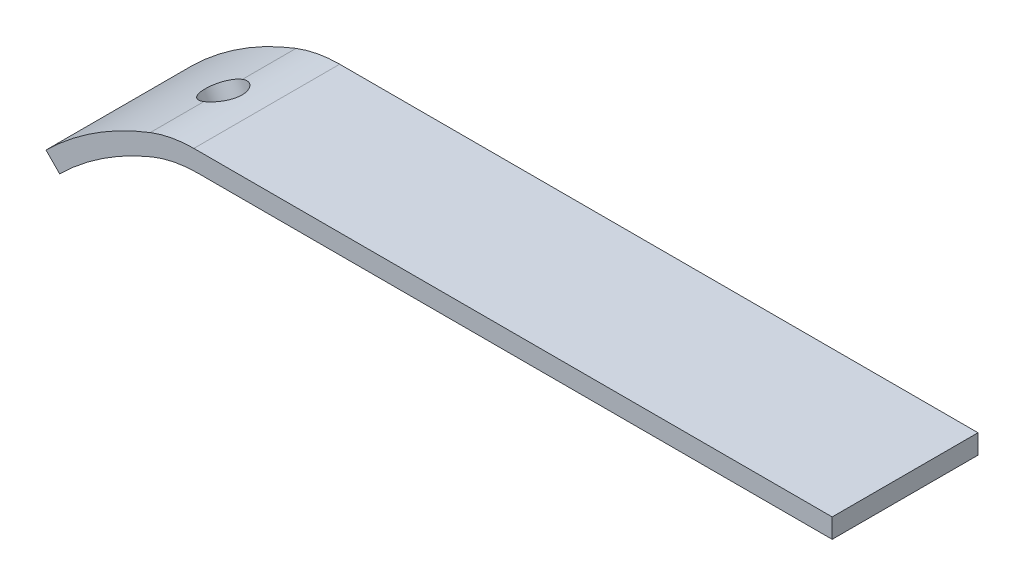
ISO-10303-21;
HEADER;
FILE_DESCRIPTION(('STEP AP214'),'2;1');
FILE_NAME('part.step','',(''),(''),'','','');
FILE_SCHEMA(('AUTOMOTIVE_DESIGN { 1 0 10303 214 1 1 1 1 }'));
ENDSEC;
DATA;
#1=APPLICATION_CONTEXT('core data for automotive mechanical design processes');
#2=APPLICATION_PROTOCOL_DEFINITION('international standard','automotive_design',2000,#1);
#3=PRODUCT_CONTEXT('',#1,'mechanical');
#4=PRODUCT('Part','Part','',(#3));
#5=PRODUCT_RELATED_PRODUCT_CATEGORY('part','',(#4));
#6=PRODUCT_DEFINITION_FORMATION('','',#4);
#7=PRODUCT_DEFINITION_CONTEXT('part definition',#1,'design');
#8=PRODUCT_DEFINITION('design','',#6,#7);
#9=PRODUCT_DEFINITION_SHAPE('','',#8);
#10=(LENGTH_UNIT() NAMED_UNIT(*) SI_UNIT(.MILLI.,.METRE.));
#11=(NAMED_UNIT(*) PLANE_ANGLE_UNIT() SI_UNIT($,.RADIAN.));
#12=(NAMED_UNIT(*) SI_UNIT($,.STERADIAN.) SOLID_ANGLE_UNIT());
#13=UNCERTAINTY_MEASURE_WITH_UNIT(LENGTH_MEASURE(1.E-05),#10,'distance_accuracy_value','');
#14=(GEOMETRIC_REPRESENTATION_CONTEXT(3) GLOBAL_UNCERTAINTY_ASSIGNED_CONTEXT((#13)) GLOBAL_UNIT_ASSIGNED_CONTEXT((#10,
#11,#12)) REPRESENTATION_CONTEXT('',''));
#15=CARTESIAN_POINT('',(0.,0.,0.));
#16=DIRECTION('',(0.,0.,1.));
#17=DIRECTION('',(1.,0.,0.));
#18=AXIS2_PLACEMENT_3D('',#15,#16,#17);
#19=CARTESIAN_POINT('',(0.,-11.,-6.));
#20=DIRECTION('',(0.,1.,0.));
#21=DIRECTION('',(-1.,0.,0.));
#22=AXIS2_PLACEMENT_3D('',#19,#20,#21);
#23=PLANE('',#22);
#24=DIRECTION('',(-1.,0.,0.));
#25=VECTOR('',#24,1.);
#26=CARTESIAN_POINT('',(0.,-11.,6.));
#27=LINE('',#26,#25);
#28=CARTESIAN_POINT('',(5.42857144064035,-11.,6.));
#29=VERTEX_POINT('',#28);
#30=CARTESIAN_POINT('',(-47.1037127257916,-11.,6.));
#31=VERTEX_POINT('',#30);
#32=EDGE_CURVE('E130',#29,#31,#27,.T.);
#33=ORIENTED_EDGE('',*,*,#32,.F.);
#34=DIRECTION('',(0.,0.,1.));
#35=VECTOR('',#34,1.);
#36=CARTESIAN_POINT('',(5.42857144064035,-11.,-6.));
#37=LINE('',#36,#35);
#38=CARTESIAN_POINT('',(5.42857144064035,-11.,-6.));
#39=VERTEX_POINT('',#38);
#40=EDGE_CURVE('E27',#39,#29,#37,.T.);
#41=ORIENTED_EDGE('',*,*,#40,.F.);
#42=DIRECTION('',(-1.,0.,0.));
#43=VECTOR('',#42,1.);
#44=CARTESIAN_POINT('',(0.,-11.,-6.));
#45=LINE('',#44,#43);
#46=CARTESIAN_POINT('',(-47.1037127257916,-11.,-6.));
#47=VERTEX_POINT('',#46);
#48=EDGE_CURVE('E152',#39,#47,#45,.T.);
#49=ORIENTED_EDGE('',*,*,#48,.T.);
#50=DIRECTION('',(0.,0.,1.));
#51=VECTOR('',#50,1.);
#52=CARTESIAN_POINT('',(-47.1037127257916,-11.,-6.));
#53=LINE('',#52,#51);
#54=EDGE_CURVE('E113',#47,#31,#53,.T.);
#55=ORIENTED_EDGE('',*,*,#54,.T.);
#56=EDGE_LOOP('',(#33,#41,#49,#55));
#57=FACE_BOUND('',#56,.T.);
#58=ADVANCED_FACE('F16',(#57),#23,.T.);
#59=CARTESIAN_POINT('',(5.42857144064035,0.,-6.));
#60=DIRECTION('',(-1.,0.,0.));
#61=DIRECTION('',(0.,0.,1.));
#62=AXIS2_PLACEMENT_3D('',#59,#60,#61);
#63=PLANE('',#62);
#64=DIRECTION('',(0.,-1.,0.));
#65=VECTOR('',#64,1.);
#66=CARTESIAN_POINT('',(5.42857144064035,0.,6.));
#67=LINE('',#66,#65);
#68=CARTESIAN_POINT('',(5.42857144064035,-12.6,6.));
#69=VERTEX_POINT('',#68);
#70=EDGE_CURVE('E150',#29,#69,#67,.T.);
#71=ORIENTED_EDGE('',*,*,#70,.T.);
#72=DIRECTION('',(0.,0.,1.));
#73=VECTOR('',#72,1.);
#74=CARTESIAN_POINT('',(5.42857144064035,-12.6,-6.));
#75=LINE('',#74,#73);
#76=CARTESIAN_POINT('',(5.42857144064035,-12.6,-6.));
#77=VERTEX_POINT('',#76);
#78=EDGE_CURVE('E154',#77,#69,#75,.T.);
#79=ORIENTED_EDGE('',*,*,#78,.F.);
#80=DIRECTION('',(0.,-1.,0.));
#81=VECTOR('',#80,1.);
#82=CARTESIAN_POINT('',(5.42857144064035,0.,-6.));
#83=LINE('',#82,#81);
#84=EDGE_CURVE('E115',#39,#77,#83,.T.);
#85=ORIENTED_EDGE('',*,*,#84,.F.);
#86=ORIENTED_EDGE('',*,*,#40,.T.);
#87=EDGE_LOOP('',(#71,#79,#85,#86));
#88=FACE_BOUND('',#87,.T.);
#89=ADVANCED_FACE('F227',(#88),#63,.F.);
#90=CARTESIAN_POINT('',(0.,-12.6,-6.));
#91=DIRECTION('',(0.,1.,0.));
#92=DIRECTION('',(-1.,0.,0.));
#93=AXIS2_PLACEMENT_3D('',#90,#91,#92);
#94=PLANE('',#93);
#95=DIRECTION('',(-1.,0.,0.));
#96=VECTOR('',#95,1.);
#97=CARTESIAN_POINT('',(0.,-12.6,6.));
#98=LINE('',#97,#96);
#99=CARTESIAN_POINT('',(-46.7978503877676,-12.6,6.));
#100=VERTEX_POINT('',#99);
#101=EDGE_CURVE('E148',#69,#100,#98,.T.);
#102=ORIENTED_EDGE('',*,*,#101,.T.);
#103=DIRECTION('',(0.,0.,1.));
#104=VECTOR('',#103,1.);
#105=CARTESIAN_POINT('',(-46.7978503877676,-12.6,-6.));
#106=LINE('',#105,#104);
#107=CARTESIAN_POINT('',(-46.7978503877676,-12.6,-6.));
#108=VERTEX_POINT('',#107);
#109=EDGE_CURVE('E157',#108,#100,#106,.T.);
#110=ORIENTED_EDGE('',*,*,#109,.F.);
#111=DIRECTION('',(-1.,0.,0.));
#112=VECTOR('',#111,1.);
#113=CARTESIAN_POINT('',(0.,-12.6,-6.));
#114=LINE('',#113,#112);
#115=EDGE_CURVE('E120',#77,#108,#114,.T.);
#116=ORIENTED_EDGE('',*,*,#115,.F.);
#117=ORIENTED_EDGE('',*,*,#78,.T.);
#118=EDGE_LOOP('',(#102,#110,#116,#117));
#119=FACE_BOUND('',#118,.T.);
#120=ADVANCED_FACE('F232',(#119),#94,.F.);
#121=CARTESIAN_POINT('',(-46.7978503877676,-22.6,-6.));
#122=DIRECTION('',(0.,0.,1.));
#123=DIRECTION('',(1.,0.,0.));
#124=AXIS2_PLACEMENT_3D('',#121,#122,#123);
#125=CYLINDRICAL_SURFACE('',#124,10.);
#126=DIRECTION('',(0.,0.,1.));
#127=VECTOR('',#126,1.);
#128=CARTESIAN_POINT('',(-50.5892017560295,-13.3465868566037,-6.));
#129=LINE('',#128,#127);
#130=CARTESIAN_POINT('',(-50.5892017560295,-13.3465868566037,1.40630201190142));
#131=VERTEX_POINT('',#130);
#132=CARTESIAN_POINT('',(-50.5892017560295,-13.3465868566037,6.));
#133=VERTEX_POINT('',#132);
#134=EDGE_CURVE('E162',#131,#133,#129,.T.);
#135=ORIENTED_EDGE('',*,*,#134,.F.);
#136=CARTESIAN_POINT('',(-50.5892017560295,-13.3465868566037,1.40630201190142));
#137=CARTESIAN_POINT('',(-50.5520496670737,-13.3313635589773,1.42713984775884));
#138=CARTESIAN_POINT('',(-50.5140023155539,-13.3160375079772,1.4462568671757));
#139=CARTESIAN_POINT('',(-50.4363562063143,-13.2853332566281,1.48095436338339));
#140=CARTESIAN_POINT('',(-50.3967577009205,-13.2699550651294,1.4965354125915));
#141=CARTESIAN_POINT('',(-50.2762016289959,-13.2240508716272,1.53776425487576));
#142=CARTESIAN_POINT('',(-50.1932722084305,-13.1936680575505,1.55801575027674));
#143=CARTESIAN_POINT('',(-50.0246638882375,-13.134501099906,1.58366585753326));
#144=CARTESIAN_POINT('',(-49.9389852013488,-13.1057168331106,1.58906561582953));
#145=CARTESIAN_POINT('',(-49.7671656629489,-13.0505860543978,1.58515398771584));
#146=CARTESIAN_POINT('',(-49.6810247210741,-13.0242400389603,1.57583961214163));
#147=CARTESIAN_POINT('',(-49.5088497025879,-12.9740614758049,1.54262407443541));
#148=CARTESIAN_POINT('',(-49.4228548927167,-12.9502923871773,1.51842440034765));
#149=CARTESIAN_POINT('',(-49.2551670935594,-12.9062329736609,1.45597417535625));
#150=CARTESIAN_POINT('',(-49.1734753610281,-12.8859436612133,1.41771954529971));
#151=CARTESIAN_POINT('',(-49.0144374263015,-12.8484046830824,1.32687030274768));
#152=CARTESIAN_POINT('',(-48.9372836209628,-12.8312591495028,1.27389511678075));
#153=CARTESIAN_POINT('',(-48.7924047418641,-12.8006508407546,1.15543592418182));
#154=CARTESIAN_POINT('',(-48.7246799227561,-12.7871881650406,1.08995157982396));
#155=CARTESIAN_POINT('',(-48.6013678859014,-12.7637784995651,0.948396408813739));
#156=CARTESIAN_POINT('',(-48.5457244844513,-12.7538150969111,0.872377402139647));
#157=CARTESIAN_POINT('',(-48.448491240883,-12.7370475263159,0.71150521712667));
#158=CARTESIAN_POINT('',(-48.4068961605136,-12.730242180463,0.626655347058047));
#159=CARTESIAN_POINT('',(-48.3415345059889,-12.7198136007712,0.45527362365517));
#160=CARTESIAN_POINT('',(-48.3169451497471,-12.7160418007847,0.369065069896105));
#161=CARTESIAN_POINT('',(-48.2834112587148,-12.7109451616178,0.193596033875882));
#162=CARTESIAN_POINT('',(-48.2744599072543,-12.7096192562478,0.104336898683925));
#163=CARTESIAN_POINT('',(-48.2727122981858,-12.7093591041251,-0.06915346677925));
#164=CARTESIAN_POINT('',(-48.2790111832585,-12.7102909014106,-0.153376759898088));
#165=CARTESIAN_POINT('',(-48.3055899816486,-12.7143083569367,-0.319524436062706));
#166=CARTESIAN_POINT('',(-48.3258693521256,-12.7173939315496,-0.401448908239578));
#167=CARTESIAN_POINT('',(-48.3793501986663,-12.7258124750662,-0.560333631980942));
#168=CARTESIAN_POINT('',(-48.4124827386205,-12.7311334670549,-0.637317855018251));
#169=CARTESIAN_POINT('',(-48.4903495310641,-12.7441895702334,-0.784943184467404));
#170=CARTESIAN_POINT('',(-48.5350862124577,-12.7519251869058,-0.855582958727722));
#171=CARTESIAN_POINT('',(-48.6371069977368,-12.7704553555874,-0.992341994389819));
#172=CARTESIAN_POINT('',(-48.6949072853594,-12.7813837005662,-1.05805769099229));
#173=CARTESIAN_POINT('',(-48.8196929284721,-12.8063184434769,-1.17941474945886));
#174=CARTESIAN_POINT('',(-48.8866811622815,-12.8203258068089,-1.23505294160557));
#175=CARTESIAN_POINT('',(-49.032084414682,-12.8524847461421,-1.33804496239601));
#176=CARTESIAN_POINT('',(-49.1109404012898,-12.8708320524982,-1.38471644767167));
#177=CARTESIAN_POINT('',(-49.2744579055781,-12.9111660534161,-1.46429155194732));
#178=CARTESIAN_POINT('',(-49.3591199169781,-12.9331530577075,-1.49719399839376));
#179=CARTESIAN_POINT('',(-49.5337266832706,-12.98109444308,-1.54882651230193));
#180=CARTESIAN_POINT('',(-49.6237459048452,-13.0071240010865,-1.56723644873825));
#181=CARTESIAN_POINT('',(-49.8047314566125,-13.0623057697099,-1.58793335844507));
#182=CARTESIAN_POINT('',(-49.8956980793809,-13.0914589724376,-1.59021519371668));
#183=CARTESIAN_POINT('',(-50.0739599592865,-13.1514138183453,-1.57841036226661));
#184=CARTESIAN_POINT('',(-50.1612922588499,-13.1821706454726,-1.56465122756652));
#185=CARTESIAN_POINT('',(-50.3314798941514,-13.2446994469815,-1.5214337329202));
#186=CARTESIAN_POINT('',(-50.4143446765329,-13.2764690335495,-1.49201005492969));
#187=CARTESIAN_POINT('',(-50.5099054017281,-13.3144758664036,-1.44764431339406));
#188=CARTESIAN_POINT('',(-50.5259894978632,-13.3209226343895,-1.43979816924253));
#189=CARTESIAN_POINT('',(-50.5578343011927,-13.3337810996439,-1.42350246975071));
#190=CARTESIAN_POINT('',(-50.5735953926374,-13.3401928310203,-1.41505369226911));
#191=CARTESIAN_POINT('',(-50.5892017560295,-13.3465868566037,-1.40630201190142));
#192=B_SPLINE_CURVE_WITH_KNOTS('',3,(#136,#137,#138,#139,#140,#141,#142,#143,#144,#145,#146,
#147,#148,#149,#150,#151,#152,#153,#154,#155,#156,#157,#158,#159,#160,#161,#162,#163,#164,#165,
#166,#167,#168,#169,#170,#171,#172,#173,#174,#175,#176,#177,#178,#179,#180,#181,#182,#183,#184,
#185,#186,#187,#188,#189,#190,#191),.UNSPECIFIED.,.F.,.F.,(4,2,2,2,2,2,2,2,2,2,2,2,2,2,2,2,2,2,
2,2,2,2,2,2,2,2,2,4),(0.,0.135619947350567,0.271217924305152,0.541652181266713,
0.812065562182067,1.08253388441915,1.35861150174577,1.63476930812235,1.91886480483646,
2.20296797272719,2.48572021352179,2.76836690670491,3.03614457134399,3.3038054814556,
3.55597792488842,3.808140577411,4.05896908466461,4.30985013615237,4.5732955813446,
4.83682374572379,5.11589810854294,5.3949962321404,5.68009882790606,5.96529224594577,
6.24476296534796,6.52361748254869,6.58067648876442,6.63766313335133),.UNSPECIFIED.);
#193=CARTESIAN_POINT('',(-50.5892017560295,-13.3465868566037,-1.40630201190142));
#194=VERTEX_POINT('',#193);
#195=EDGE_CURVE('E33',#131,#194,#192,.T.);
#196=ORIENTED_EDGE('',*,*,#195,.T.);
#197=CARTESIAN_POINT('',(-50.5892017560295,-13.3465868566037,-6.));
#198=VERTEX_POINT('',#197);
#199=EDGE_CURVE('E160',#198,#194,#129,.T.);
#200=ORIENTED_EDGE('',*,*,#199,.F.);
#201=CARTESIAN_POINT('',(-46.7978503877676,-22.6,-6.));
#202=DIRECTION('',(0.,0.,1.));
#203=DIRECTION('',(1.,0.,0.));
#204=AXIS2_PLACEMENT_3D('',#201,#202,#203);
#205=CIRCLE('',#204,10.);
#206=EDGE_CURVE('E126',#108,#198,#205,.T.);
#207=ORIENTED_EDGE('',*,*,#206,.F.);
#208=ORIENTED_EDGE('',*,*,#109,.T.);
#209=CARTESIAN_POINT('',(-46.7978503877676,-22.6,6.));
#210=DIRECTION('',(0.,0.,1.));
#211=DIRECTION('',(1.,0.,0.));
#212=AXIS2_PLACEMENT_3D('',#209,#210,#211);
#213=CIRCLE('',#212,10.);
#214=EDGE_CURVE('E145',#100,#133,#213,.T.);
#215=ORIENTED_EDGE('',*,*,#214,.T.);
#216=EDGE_LOOP('',(#135,#196,#200,#207,#208,#215));
#217=FACE_BOUND('',#216,.T.);
#218=ADVANCED_FACE('F173',(#217),#125,.F.);
#219=CARTESIAN_POINT('',(-41.7174395542967,-34.999573612151,-6.));
#220=DIRECTION('',(0.,0.,1.));
#221=DIRECTION('',(1.,0.,0.));
#222=AXIS2_PLACEMENT_3D('',#219,#220,#221);
#223=CYLINDRICAL_SURFACE('',#222,23.4);
#224=ORIENTED_EDGE('',*,*,#199,.T.);
#225=CARTESIAN_POINT('',(-50.5892017560295,-13.3465868566037,-1.40630201190142));
#226=CARTESIAN_POINT('',(-50.6259338497092,-13.3616364544577,-1.38570040443848));
#227=CARTESIAN_POINT('',(-50.6618115343082,-13.3764461056886,-1.36344508729487));
#228=CARTESIAN_POINT('',(-50.7316483322269,-13.4054663949299,-1.31576126678133));
#229=CARTESIAN_POINT('',(-50.7656074670764,-13.4196770396619,-1.29033279903072));
#230=CARTESIAN_POINT('',(-50.8641989138108,-13.4611924027626,-1.20956586061412));
#231=CARTESIAN_POINT('',(-50.9256522334502,-13.4874245668834,-1.14968574898929));
#232=CARTESIAN_POINT('',(-51.0382560916435,-13.5359727940275,-1.01953087055874));
#233=CARTESIAN_POINT('',(-51.0893999442166,-13.5582863144993,-0.949249409085705));
#234=CARTESIAN_POINT('',(-51.1799798644692,-13.5981067556392,-0.800294931328933));
#235=CARTESIAN_POINT('',(-51.219419069756,-13.6156149643488,-0.721624171623601));
#236=CARTESIAN_POINT('',(-51.2854039029488,-13.6450573108592,-0.558457618103908));
#237=CARTESIAN_POINT('',(-51.3120004627231,-13.6570134598813,-0.4739863773012));
#238=CARTESIAN_POINT('',(-51.351839583601,-13.6749676848998,-0.301326992332803));
#239=CARTESIAN_POINT('',(-51.3650800562684,-13.680964829109,-0.213138269125016));
#240=CARTESIAN_POINT('',(-51.3778380818541,-13.6867429539977,-0.0357610861229038));
#241=CARTESIAN_POINT('',(-51.3773845798186,-13.6865370461123,0.0534248667192619));
#242=CARTESIAN_POINT('',(-51.3628387872053,-13.6799503610255,0.2304388370502));
#243=CARTESIAN_POINT('',(-51.3487476776402,-13.6735701185198,0.318266971456508));
#244=CARTESIAN_POINT('',(-51.3073048417091,-13.6549022491895,0.490046627614792));
#245=CARTESIAN_POINT('',(-51.2799580462292,-13.642616819007,0.573999578160107));
#246=CARTESIAN_POINT('',(-51.2127153671649,-13.6126363824801,0.735703461586438));
#247=CARTESIAN_POINT('',(-51.1728172949778,-13.5949404327028,0.813453309848116));
#248=CARTESIAN_POINT('',(-51.0814841391716,-13.5548270607035,0.960634276743199));
#249=CARTESIAN_POINT('',(-51.0300337893789,-13.5324033932829,1.03005419951034));
#250=CARTESIAN_POINT('',(-50.9170156325412,-13.4837291578181,1.15848654478691));
#251=CARTESIAN_POINT('',(-50.8554572682622,-13.4574821640312,1.21750857519144));
#252=CARTESIAN_POINT('',(-50.7580940567472,-13.4165304961836,1.29602722184476));
#253=CARTESIAN_POINT('',(-50.7254795870156,-13.40289499625,1.3201535156204));
#254=CARTESIAN_POINT('',(-50.6585681632784,-13.3751075754405,1.36545244908869));
#255=CARTESIAN_POINT('',(-50.6242744938421,-13.3609566755876,1.38663056625313));
#256=CARTESIAN_POINT('',(-50.5892017560295,-13.3465868566037,1.40630201190143));
#257=B_SPLINE_CURVE_WITH_KNOTS('',3,(#225,#226,#227,#228,#229,#230,#231,#232,#233,#234,#235,
#236,#237,#238,#239,#240,#241,#242,#243,#244,#245,#246,#247,#248,#249,#250,#251,#252,#253,#254,
#255,#256),.UNSPECIFIED.,.F.,.F.,(4,2,2,2,2,2,2,2,2,2,2,2,2,2,2,4),(0.,0.134088604249115,
0.26817570345873,0.535963798447449,0.803925006769434,1.07181431903162,1.33863231713914,
1.60549203001262,1.87178771928133,2.13806034948765,2.40423400679801,2.67045410333267,
2.93702809848224,3.20335446611124,3.33163197498382,3.45966787970708),.UNSPECIFIED.);
#258=EDGE_CURVE('E103',#194,#131,#257,.T.);
#259=ORIENTED_EDGE('',*,*,#258,.T.);
#260=ORIENTED_EDGE('',*,*,#134,.T.);
#261=CARTESIAN_POINT('',(-41.7174395542967,-34.999573612151,6.));
#262=DIRECTION('',(0.,0.,1.));
#263=DIRECTION('',(1.,0.,0.));
#264=AXIS2_PLACEMENT_3D('',#261,#262,#263);
#265=CIRCLE('',#264,23.4);
#266=CARTESIAN_POINT('',(-58.1500788342331,-18.3403909702717,6.));
#267=VERTEX_POINT('',#266);
#268=EDGE_CURVE('E142',#133,#267,#265,.T.);
#269=ORIENTED_EDGE('',*,*,#268,.T.);
#270=DIRECTION('',(0.,0.,1.));
#271=VECTOR('',#270,1.);
#272=CARTESIAN_POINT('',(-58.1500788342331,-18.3403909702717,-6.));
#273=LINE('',#272,#271);
#274=CARTESIAN_POINT('',(-58.1500788342331,-18.3403909702717,-6.));
#275=VERTEX_POINT('',#274);
#276=EDGE_CURVE('E111',#275,#267,#273,.T.);
#277=ORIENTED_EDGE('',*,*,#276,.F.);
#278=CARTESIAN_POINT('',(-41.7174395542967,-34.999573612151,-6.));
#279=DIRECTION('',(0.,0.,1.));
#280=DIRECTION('',(1.,0.,0.));
#281=AXIS2_PLACEMENT_3D('',#278,#279,#280);
#282=CIRCLE('',#281,23.4);
#283=EDGE_CURVE('E185',#198,#275,#282,.T.);
#284=ORIENTED_EDGE('',*,*,#283,.F.);
#285=EDGE_LOOP('',(#224,#259,#260,#269,#277,#284));
#286=FACE_BOUND('',#285,.T.);
#287=ADVANCED_FACE('F169',(#286),#223,.F.);
#288=CARTESIAN_POINT('',(-38.6424464658694,-38.1169591160836,-6.));
#289=DIRECTION('',(-0.711930882131594,-0.702249541877622,0.));
#290=DIRECTION('',(0.702249541877622,-0.711930882131594,0.));
#291=AXIS2_PLACEMENT_3D('',#288,#289,#290);
#292=PLANE('',#291);
#293=DIRECTION('',(0.702249541877622,-0.711930882131594,0.));
#294=VECTOR('',#293,1.);
#295=CARTESIAN_POINT('',(-38.6424464658694,-38.1169591160836,6.));
#296=LINE('',#295,#294);
#297=CARTESIAN_POINT('',(-59.2736781012373,-17.2013015588612,6.));
#298=VERTEX_POINT('',#297);
#299=EDGE_CURVE('E139',#298,#267,#296,.T.);
#300=ORIENTED_EDGE('',*,*,#299,.F.);
#301=DIRECTION('',(0.,0.,1.));
#302=VECTOR('',#301,1.);
#303=CARTESIAN_POINT('',(-59.2736781012373,-17.2013015588612,-6.));
#304=LINE('',#303,#302);
#305=CARTESIAN_POINT('',(-59.2736781012373,-17.2013015588612,-6.));
#306=VERTEX_POINT('',#305);
#307=EDGE_CURVE('E109',#306,#298,#304,.T.);
#308=ORIENTED_EDGE('',*,*,#307,.F.);
#309=DIRECTION('',(0.702249541877622,-0.711930882131594,0.));
#310=VECTOR('',#309,1.);
#311=CARTESIAN_POINT('',(-38.6424464658694,-38.1169591160836,-6.));
#312=LINE('',#311,#310);
#313=EDGE_CURVE('E181',#306,#275,#312,.T.);
#314=ORIENTED_EDGE('',*,*,#313,.T.);
#315=ORIENTED_EDGE('',*,*,#276,.T.);
#316=EDGE_LOOP('',(#300,#308,#314,#315));
#317=FACE_BOUND('',#316,.T.);
#318=ADVANCED_FACE('F179',(#317),#292,.T.);
#319=CARTESIAN_POINT('',(-41.7174395542967,-34.999573612151,-6.));
#320=DIRECTION('',(0.,0.,1.));
#321=DIRECTION('',(1.,0.,0.));
#322=AXIS2_PLACEMENT_3D('',#319,#320,#321);
#323=CYLINDRICAL_SURFACE('',#322,25.);
#324=CARTESIAN_POINT('',(-50.6945615067881,-11.6669509252327,-1.58745428520288));
#325=CARTESIAN_POINT('',(-50.7368228500294,-11.6832100668387,-1.58779319719321));
#326=CARTESIAN_POINT('',(-50.77903323006,-11.6995830272249,-1.58624150291836));
#327=CARTESIAN_POINT('',(-50.8630974006721,-11.7324514241177,-1.57936251914526));
#328=CARTESIAN_POINT('',(-50.9049511877341,-11.7489468618303,-1.57403519242448));
#329=CARTESIAN_POINT('',(-51.0294945018439,-11.7984189754524,-1.5524155780309));
#330=CARTESIAN_POINT('',(-51.1112688270078,-11.8314210546113,-1.53048643307643));
#331=CARTESIAN_POINT('',(-51.2699299916243,-11.8963854771918,-1.47210567541371));
#332=CARTESIAN_POINT('',(-51.3468131431839,-11.9283470274044,-1.43564325179328));
#333=CARTESIAN_POINT('',(-51.493482444978,-11.9901121454132,-1.34917187816782));
#334=CARTESIAN_POINT('',(-51.5632710852983,-12.019916469304,-1.29916770388602));
#335=CARTESIAN_POINT('',(-51.6932910321326,-12.0760622063373,-1.18743379956691));
#336=CARTESIAN_POINT('',(-51.7535921139119,-12.1024286306614,-1.12579779496819));
#337=CARTESIAN_POINT('',(-51.8636307553395,-12.1509756186833,-0.992274529855961));
#338=CARTESIAN_POINT('',(-51.9133667179228,-12.1731555494778,-0.920385722229758));
#339=CARTESIAN_POINT('',(-52.000592596138,-12.212317475948,-0.768953698081089));
#340=CARTESIAN_POINT('',(-52.0381655250343,-12.2293346552514,-0.689467381065809));
#341=CARTESIAN_POINT('',(-52.1005314374826,-12.257705099896,-0.524689523502273));
#342=CARTESIAN_POINT('',(-52.1253255717389,-12.2690588752123,-0.43939850643863));
#343=CARTESIAN_POINT('',(-52.1614279598682,-12.2856240764579,-0.265697384438442));
#344=CARTESIAN_POINT('',(-52.1727755743033,-12.2908534292295,-0.17729716686465));
#345=CARTESIAN_POINT('',(-52.1818200794063,-12.2950197478932,0.00034790898318282));
#346=CARTESIAN_POINT('',(-52.1795167249316,-12.2939566007854,0.0895927823967187));
#347=CARTESIAN_POINT('',(-52.1613263280128,-12.2855839369627,0.266314827014353));
#348=CARTESIAN_POINT('',(-52.1454503727717,-12.278279518628,0.353793381403975));
#349=CARTESIAN_POINT('',(-52.1005457876552,-12.2577243138576,0.524575310970601));
#350=CARTESIAN_POINT('',(-52.0715172798032,-12.2444735825892,0.607878724874741));
#351=CARTESIAN_POINT('',(-52.0010619707574,-12.2125466289623,0.767978791642297));
#352=CARTESIAN_POINT('',(-51.9596311519591,-12.1938686485584,0.844773325659876));
#353=CARTESIAN_POINT('',(-51.8654802218463,-12.1518183762733,0.989658331190841));
#354=CARTESIAN_POINT('',(-51.8127605036522,-12.1284462478611,1.05774910566881));
#355=CARTESIAN_POINT('',(-51.6973494841761,-12.0778510419144,1.18344097824541));
#356=CARTESIAN_POINT('',(-51.6346409521015,-12.0506213191421,1.24102357447994));
#357=CARTESIAN_POINT('',(-51.5010033092387,-11.9933319398292,1.34398535227355));
#358=CARTESIAN_POINT('',(-51.4300719968603,-11.9632715257978,1.38936125472991));
#359=CARTESIAN_POINT('',(-51.2815446599213,-11.9012098853625,1.46689875733028));
#360=CARTESIAN_POINT('',(-51.2039137236108,-11.8691987840052,1.49898536952172));
#361=CARTESIAN_POINT('',(-51.0445064610471,-11.8044622339692,1.5487351293835));
#362=CARTESIAN_POINT('',(-50.9627352986038,-11.7717377027739,1.5664157957685));
#363=CARTESIAN_POINT('',(-50.8493249213764,-11.7270624390174,1.58054766756406));
#364=CARTESIAN_POINT('',(-50.8184344938783,-11.7149649919236,1.58335832772381));
#365=CARTESIAN_POINT('',(-50.7565597212108,-11.6908755892691,1.58693347675493));
#366=CARTESIAN_POINT('',(-50.7255756515724,-11.6788834811092,1.58770170279836));
#367=CARTESIAN_POINT('',(-50.6945615067881,-11.6669509252327,1.58745428520288));
#368=B_SPLINE_CURVE_WITH_KNOTS('',3,(#324,#325,#326,#327,#328,#329,#330,#331,#332,#333,#334,
#335,#336,#337,#338,#339,#340,#341,#342,#343,#344,#345,#346,#347,#348,#349,#350,#351,#352,#353,
#354,#355,#356,#357,#358,#359,#360,#361,#362,#363,#364,#365,#366,#367),.UNSPECIFIED.,.F.,.F.,(4,
2,2,2,2,2,2,2,2,2,2,2,2,2,2,2,2,2,2,2,2,4),(0.,0.135765601497907,0.271532541476046,
0.542739963939759,0.814149507899564,1.0854634591452,1.35467800461173,1.62393321669242,
1.89130998273441,2.15866266783783,2.42523081138485,2.69180374194524,2.95815912191792,
3.22451203081428,3.49095131561122,3.75738132353645,4.02427600446942,4.29124231029383,
4.55969516127863,4.82782106408503,4.92765364582123,5.02730343138721),.UNSPECIFIED.);
#369=CARTESIAN_POINT('',(-50.6945615067881,-11.6669509252327,-1.58745428520288));
#370=VERTEX_POINT('',#369);
#371=CARTESIAN_POINT('',(-50.6945615067881,-11.6669509252327,1.58745428520288));
#372=VERTEX_POINT('',#371);
#373=EDGE_CURVE('E39',#370,#372,#368,.T.);
#374=ORIENTED_EDGE('',*,*,#373,.F.);
#375=DIRECTION('',(0.,0.,1.));
#376=VECTOR('',#375,1.);
#377=CARTESIAN_POINT('',(-50.6945615067881,-11.6669509252327,-6.));
#378=LINE('',#377,#376);
#379=CARTESIAN_POINT('',(-50.6945615067881,-11.6669509252327,-6.));
#380=VERTEX_POINT('',#379);
#381=EDGE_CURVE('E99',#380,#370,#378,.T.);
#382=ORIENTED_EDGE('',*,*,#381,.F.);
#383=CARTESIAN_POINT('',(-41.7174395542967,-34.999573612151,-6.));
#384=DIRECTION('',(0.,0.,1.));
#385=DIRECTION('',(1.,0.,0.));
#386=AXIS2_PLACEMENT_3D('',#383,#384,#385);
#387=CIRCLE('',#386,25.);
#388=EDGE_CURVE('E183',#380,#306,#387,.T.);
#389=ORIENTED_EDGE('',*,*,#388,.T.);
#390=ORIENTED_EDGE('',*,*,#307,.T.);
#391=CARTESIAN_POINT('',(-41.7174395542967,-34.999573612151,6.));
#392=DIRECTION('',(0.,0.,1.));
#393=DIRECTION('',(1.,0.,0.));
#394=AXIS2_PLACEMENT_3D('',#391,#392,#393);
#395=CIRCLE('',#394,25.);
#396=CARTESIAN_POINT('',(-50.6945615067881,-11.6669509252327,6.));
#397=VERTEX_POINT('',#396);
#398=EDGE_CURVE('E136',#397,#298,#395,.T.);
#399=ORIENTED_EDGE('',*,*,#398,.F.);
#400=EDGE_CURVE('E102',#372,#397,#378,.T.);
#401=ORIENTED_EDGE('',*,*,#400,.F.);
#402=EDGE_LOOP('',(#374,#382,#389,#390,#399,#401));
#403=FACE_BOUND('',#402,.T.);
#404=ADVANCED_FACE('F97',(#403),#323,.T.);
#405=CARTESIAN_POINT('',(-47.1037127257916,-21.,-6.));
#406=DIRECTION('',(0.,0.,1.));
#407=DIRECTION('',(1.,0.,0.));
#408=AXIS2_PLACEMENT_3D('',#405,#406,#407);
#409=CYLINDRICAL_SURFACE('',#408,10.);
#410=CARTESIAN_POINT('',(-50.6945615067881,-11.6669509252327,1.58745428520288));
#411=CARTESIAN_POINT('',(-50.6515976281497,-11.6504188405532,1.58710890993022));
#412=CARTESIAN_POINT('',(-50.6085544089346,-11.6342010896045,1.58480962998844));
#413=CARTESIAN_POINT('',(-50.5225920032896,-11.6024812916721,1.57635131432844));
#414=CARTESIAN_POINT('',(-50.4796727963146,-11.5869791189099,1.57019295972138));
#415=CARTESIAN_POINT('',(-50.3516836504528,-11.5417319962003,1.54603434754671));
#416=CARTESIAN_POINT('',(-50.2671974780887,-11.5131755576752,1.52234863677625));
#417=CARTESIAN_POINT('',(-50.1024636211441,-11.4598212149059,1.46062412580512));
#418=CARTESIAN_POINT('',(-50.0222153212592,-11.4350227640498,1.42258741581938));
#419=CARTESIAN_POINT('',(-49.8682268083036,-11.3893854209207,1.33322891728877));
#420=CARTESIAN_POINT('',(-49.794487545999,-11.3685471065887,1.28190519221955));
#421=CARTESIAN_POINT('',(-49.6549514659163,-11.3306421633479,1.16658541899683));
#422=CARTESIAN_POINT('',(-49.5892631625598,-11.3136249322664,1.10244165639771));
#423=CARTESIAN_POINT('',(-49.4691474544667,-11.2835932330405,0.963525417823526));
#424=CARTESIAN_POINT('',(-49.4147200677846,-11.2705787713136,0.888752924807823));
#425=CARTESIAN_POINT('',(-49.3200063943134,-11.2485704807745,0.73185904962678));
#426=CARTESIAN_POINT('',(-49.2795055441882,-11.2395150025875,0.649876154472564));
#427=CARTESIAN_POINT('',(-49.2131762855157,-11.2249640728086,0.479885222967821));
#428=CARTESIAN_POINT('',(-49.1873423782598,-11.219467286937,0.391879458504599));
#429=CARTESIAN_POINT('',(-49.1523469066198,-11.2120786068017,0.216551120316916));
#430=CARTESIAN_POINT('',(-49.1424943022731,-11.2100371195443,0.129372556486188));
#431=CARTESIAN_POINT('',(-49.1377302635536,-11.2090459607215,-0.045402988001754));
#432=CARTESIAN_POINT('',(-49.1428162346398,-11.2100957522609,-0.132999893362945));
#433=CARTESIAN_POINT('',(-49.1673313087959,-11.2152351072632,-0.303509102066705));
#434=CARTESIAN_POINT('',(-49.1863488735779,-11.2192374751656,-0.386483794130073));
#435=CARTESIAN_POINT('',(-49.2374561157558,-11.230260137301,-0.548084926792613));
#436=CARTESIAN_POINT('',(-49.2695468160671,-11.2372806676943,-0.626711026586608));
#437=CARTESIAN_POINT('',(-49.3462492955692,-11.2546115731308,-0.778974117297181));
#438=CARTESIAN_POINT('',(-49.3910744108251,-11.2649784509326,-0.85249695970868));
#439=CARTESIAN_POINT('',(-49.4914029083248,-11.2890993534176,-0.991222148793886));
#440=CARTESIAN_POINT('',(-49.5469080345296,-11.3028539313881,-1.05642313367823));
#441=CARTESIAN_POINT('',(-49.6695069961817,-11.3345524872117,-1.17970961072241));
#442=CARTESIAN_POINT('',(-49.7370047981059,-11.352654846294,-1.23735286684378));
#443=CARTESIAN_POINT('',(-49.8796806094579,-11.3927377382679,-1.34059381279418));
#444=CARTESIAN_POINT('',(-49.9548627211295,-11.4147203472186,-1.38618502161087));
#445=CARTESIAN_POINT('',(-50.1129836060905,-11.4631596659148,-1.46527012917781));
#446=CARTESIAN_POINT('',(-50.1960854366584,-11.4897289093655,-1.49836897823637));
#447=CARTESIAN_POINT('',(-50.36553009657,-11.5465091079954,-1.54946489460639));
#448=CARTESIAN_POINT('',(-50.4518670038541,-11.5767136132388,-1.56748827090188));
#449=CARTESIAN_POINT('',(-50.5644793265418,-11.6178961085068,-1.5807104955155));
#450=CARTESIAN_POINT('',(-50.5905263421984,-11.6275452091889,-1.5830563867846));
#451=CARTESIAN_POINT('',(-50.6425779997306,-11.6470753248573,-1.58632210204472));
#452=CARTESIAN_POINT('',(-50.668582646443,-11.6569559694022,-1.58724406453351));
#453=CARTESIAN_POINT('',(-50.6945615067881,-11.6669509252327,-1.58745428520288));
#454=B_SPLINE_CURVE_WITH_KNOTS('',3,(#410,#411,#412,#413,#414,#415,#416,#417,#418,#419,#420,
#421,#422,#423,#424,#425,#426,#427,#428,#429,#430,#431,#432,#433,#434,#435,#436,#437,#438,#439,
#440,#441,#442,#443,#444,#445,#446,#447,#448,#449,#450,#451,#452,#453),.UNSPECIFIED.,.F.,.F.,(4,
2,2,2,2,2,2,2,2,2,2,2,2,2,2,2,2,2,2,2,2,4),(0.,0.138019045136652,0.276013737325365,
0.551417245890444,0.826780657565399,1.10218422486938,1.38096583512196,1.65974789233952,
1.9340190528393,2.20818731972399,2.47014978996596,2.73206676509496,2.98654366565221,
3.24104048173681,3.50008139999636,3.75916465353033,4.02970646699347,4.30039347025835,
4.57903833362847,4.8571958988757,4.94079716770721,5.02427275920267),.UNSPECIFIED.);
#455=EDGE_CURVE('E10',#372,#370,#454,.T.);
#456=ORIENTED_EDGE('',*,*,#455,.F.);
#457=ORIENTED_EDGE('',*,*,#400,.T.);
#458=CARTESIAN_POINT('',(-47.1037127257916,-21.,6.));
#459=DIRECTION('',(0.,0.,1.));
#460=DIRECTION('',(1.,0.,0.));
#461=AXIS2_PLACEMENT_3D('',#458,#459,#460);
#462=CIRCLE('',#461,10.);
#463=EDGE_CURVE('E133',#31,#397,#462,.T.);
#464=ORIENTED_EDGE('',*,*,#463,.F.);
#465=ORIENTED_EDGE('',*,*,#54,.F.);
#466=CARTESIAN_POINT('',(-47.1037127257916,-21.,-6.));
#467=DIRECTION('',(0.,0.,1.));
#468=DIRECTION('',(1.,0.,0.));
#469=AXIS2_PLACEMENT_3D('',#466,#467,#468);
#470=CIRCLE('',#469,10.);
#471=EDGE_CURVE('E108',#47,#380,#470,.T.);
#472=ORIENTED_EDGE('',*,*,#471,.T.);
#473=ORIENTED_EDGE('',*,*,#381,.T.);
#474=EDGE_LOOP('',(#456,#457,#464,#465,#472,#473));
#475=FACE_BOUND('',#474,.T.);
#476=ADVANCED_FACE('F106',(#475),#409,.T.);
#477=CARTESIAN_POINT('',(0.,0.,-6.));
#478=DIRECTION('',(0.,0.,1.));
#479=DIRECTION('',(1.,0.,0.));
#480=AXIS2_PLACEMENT_3D('',#477,#478,#479);
#481=PLANE('',#480);
#482=ORIENTED_EDGE('',*,*,#48,.F.);
#483=ORIENTED_EDGE('',*,*,#84,.T.);
#484=ORIENTED_EDGE('',*,*,#115,.T.);
#485=ORIENTED_EDGE('',*,*,#206,.T.);
#486=ORIENTED_EDGE('',*,*,#283,.T.);
#487=ORIENTED_EDGE('',*,*,#313,.F.);
#488=ORIENTED_EDGE('',*,*,#388,.F.);
#489=ORIENTED_EDGE('',*,*,#471,.F.);
#490=EDGE_LOOP('',(#482,#483,#484,#485,#486,#487,#488,#489));
#491=FACE_BOUND('',#490,.T.);
#492=ADVANCED_FACE('F182',(#491),#481,.F.);
#493=CARTESIAN_POINT('',(0.,0.,6.));
#494=DIRECTION('',(0.,0.,1.));
#495=DIRECTION('',(1.,0.,0.));
#496=AXIS2_PLACEMENT_3D('',#493,#494,#495);
#497=PLANE('',#496);
#498=ORIENTED_EDGE('',*,*,#32,.T.);
#499=ORIENTED_EDGE('',*,*,#463,.T.);
#500=ORIENTED_EDGE('',*,*,#398,.T.);
#501=ORIENTED_EDGE('',*,*,#299,.T.);
#502=ORIENTED_EDGE('',*,*,#268,.F.);
#503=ORIENTED_EDGE('',*,*,#214,.F.);
#504=ORIENTED_EDGE('',*,*,#101,.F.);
#505=ORIENTED_EDGE('',*,*,#70,.F.);
#506=EDGE_LOOP('',(#498,#499,#500,#501,#502,#503,#504,#505));
#507=FACE_BOUND('',#506,.T.);
#508=ADVANCED_FACE('F178',(#507),#497,.T.);
#509=CARTESIAN_POINT('',(-41.5714285133113,-27.4927758053305,0.));
#510=DIRECTION('',(0.5,-0.866025403784442,0.));
#511=DIRECTION('',(0.866025403784442,0.5,0.));
#512=AXIS2_PLACEMENT_3D('',#509,#510,#511);
#513=CYLINDRICAL_SURFACE('',#512,1.5875);
#514=ORIENTED_EDGE('',*,*,#373,.T.);
#515=ORIENTED_EDGE('',*,*,#455,.T.);
#516=EDGE_LOOP('',(#514,#515));
#517=FACE_BOUND('',#516,.T.);
#518=ORIENTED_EDGE('',*,*,#258,.F.);
#519=ORIENTED_EDGE('',*,*,#195,.F.);
#520=EDGE_LOOP('',(#518,#519));
#521=FACE_BOUND('',#520,.T.);
#522=ADVANCED_FACE('F92',(#517,#521),#513,.F.);
#523=CLOSED_SHELL('',(#58,#89,#120,#218,#287,#318,#404,#476,#492,#508,#522));
#524=MANIFOLD_SOLID_BREP('B1',#523);
#525=ADVANCED_BREP_SHAPE_REPRESENTATION('',(#18,#524),#14);
#526=SHAPE_DEFINITION_REPRESENTATION(#9,#525);
ENDSEC;
END-ISO-10303-21;
